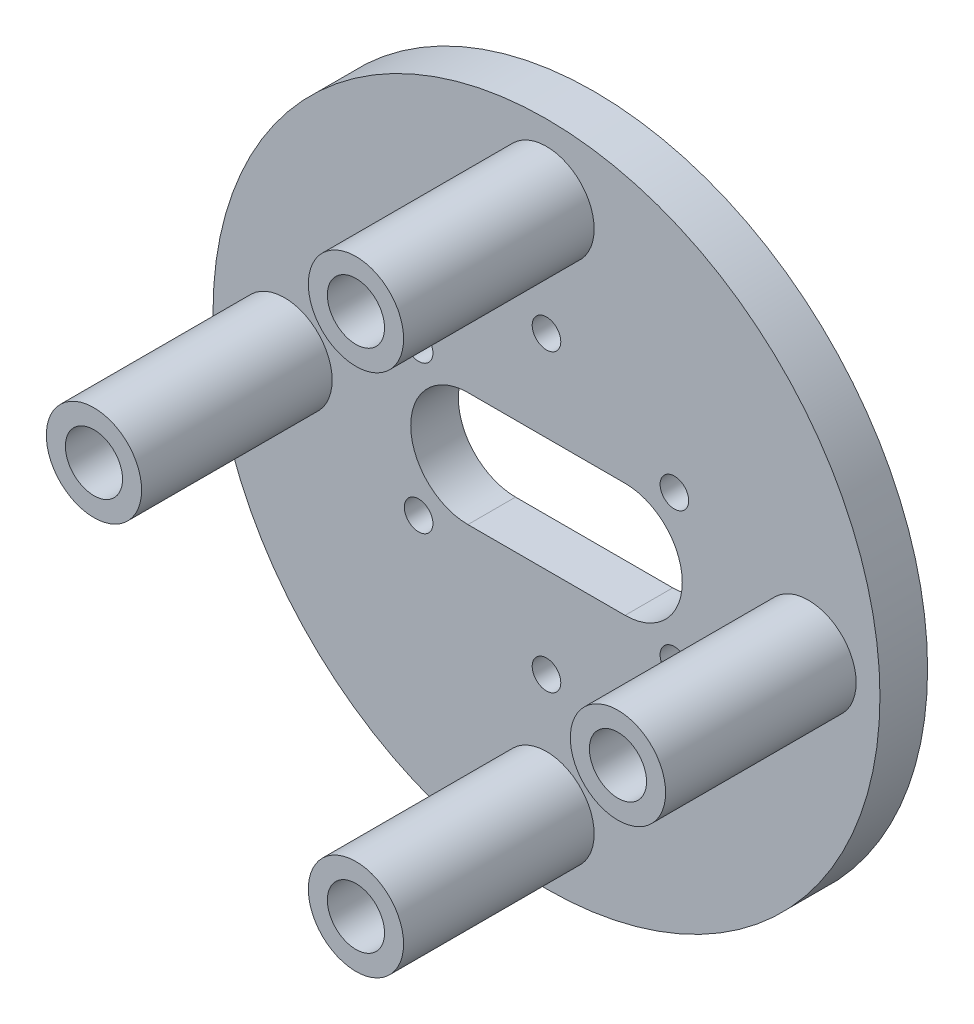
ISO-10303-21;
HEADER;
FILE_DESCRIPTION(('STEP AP214'),'2;1');
FILE_NAME('part.step','',(''),(''),'','','');
FILE_SCHEMA(('AUTOMOTIVE_DESIGN { 1 0 10303 214 1 1 1 1 }'));
ENDSEC;
DATA;
#1=APPLICATION_CONTEXT('core data for automotive mechanical design processes');
#2=APPLICATION_PROTOCOL_DEFINITION('international standard','automotive_design',2000,#1);
#3=PRODUCT_CONTEXT('',#1,'mechanical');
#4=PRODUCT('Part','Part','',(#3));
#5=PRODUCT_RELATED_PRODUCT_CATEGORY('part','',(#4));
#6=PRODUCT_DEFINITION_FORMATION('','',#4);
#7=PRODUCT_DEFINITION_CONTEXT('part definition',#1,'design');
#8=PRODUCT_DEFINITION('design','',#6,#7);
#9=PRODUCT_DEFINITION_SHAPE('','',#8);
#10=(LENGTH_UNIT() NAMED_UNIT(*) SI_UNIT(.MILLI.,.METRE.));
#11=(NAMED_UNIT(*) PLANE_ANGLE_UNIT() SI_UNIT($,.RADIAN.));
#12=(NAMED_UNIT(*) SI_UNIT($,.STERADIAN.) SOLID_ANGLE_UNIT());
#13=UNCERTAINTY_MEASURE_WITH_UNIT(LENGTH_MEASURE(1.E-05),#10,'distance_accuracy_value','');
#14=(GEOMETRIC_REPRESENTATION_CONTEXT(3) GLOBAL_UNCERTAINTY_ASSIGNED_CONTEXT((#13)) GLOBAL_UNIT_ASSIGNED_CONTEXT((#10,
#11,#12)) REPRESENTATION_CONTEXT('',''));
#15=CARTESIAN_POINT('',(0.,0.,0.));
#16=DIRECTION('',(0.,0.,1.));
#17=DIRECTION('',(1.,0.,0.));
#18=AXIS2_PLACEMENT_3D('',#15,#16,#17);
#19=CARTESIAN_POINT('',(0.,0.,5.));
#20=DIRECTION('',(0.,0.,-1.));
#21=DIRECTION('',(-1.,0.,0.));
#22=AXIS2_PLACEMENT_3D('',#19,#20,#21);
#23=CYLINDRICAL_SURFACE('',#22,35.);
#24=CARTESIAN_POINT('',(0.,0.,5.));
#25=DIRECTION('',(0.,0.,1.));
#26=DIRECTION('',(1.,0.,0.));
#27=AXIS2_PLACEMENT_3D('',#24,#25,#26);
#28=CIRCLE('',#27,35.);
#29=CARTESIAN_POINT('',(35.,0.,5.));
#30=VERTEX_POINT('',#29);
#31=EDGE_CURVE('E151',#30,#30,#28,.T.);
#32=ORIENTED_EDGE('',*,*,#31,.F.);
#33=EDGE_LOOP('',(#32));
#34=FACE_BOUND('',#33,.T.);
#35=CARTESIAN_POINT('',(0.,0.,0.));
#36=DIRECTION('',(0.,0.,1.));
#37=DIRECTION('',(1.,0.,0.));
#38=AXIS2_PLACEMENT_3D('',#35,#36,#37);
#39=CIRCLE('',#38,35.);
#40=CARTESIAN_POINT('',(35.,0.,0.));
#41=VERTEX_POINT('',#40);
#42=EDGE_CURVE('E148',#41,#41,#39,.T.);
#43=ORIENTED_EDGE('',*,*,#42,.T.);
#44=EDGE_LOOP('',(#43));
#45=FACE_BOUND('',#44,.T.);
#46=ADVANCED_FACE('F32',(#34,#45),#23,.T.);
#47=CARTESIAN_POINT('',(0.,0.,5.));
#48=DIRECTION('',(0.,0.,1.));
#49=DIRECTION('',(1.,0.,0.));
#50=AXIS2_PLACEMENT_3D('',#47,#48,#49);
#51=PLANE('',#50);
#52=CARTESIAN_POINT('',(0.,15.5,5.));
#53=DIRECTION('',(0.,0.,1.));
#54=DIRECTION('',(1.,0.,0.));
#55=AXIS2_PLACEMENT_3D('',#52,#53,#54);
#56=CIRCLE('',#55,1.5);
#57=CARTESIAN_POINT('',(1.5,15.5,5.));
#58=VERTEX_POINT('',#57);
#59=EDGE_CURVE('E192',#58,#58,#56,.T.);
#60=ORIENTED_EDGE('',*,*,#59,.F.);
#61=EDGE_LOOP('',(#60));
#62=FACE_BOUND('',#61,.T.);
#63=CARTESIAN_POINT('',(-13.4233937586588,7.75000000000006,5.));
#64=DIRECTION('',(0.,0.,1.));
#65=DIRECTION('',(1.,0.,0.));
#66=AXIS2_PLACEMENT_3D('',#63,#64,#65);
#67=CIRCLE('',#66,1.5);
#68=CARTESIAN_POINT('',(-11.9233937586588,7.75000000000006,5.));
#69=VERTEX_POINT('',#68);
#70=EDGE_CURVE('E195',#69,#69,#67,.T.);
#71=ORIENTED_EDGE('',*,*,#70,.F.);
#72=EDGE_LOOP('',(#71));
#73=FACE_BOUND('',#72,.T.);
#74=CARTESIAN_POINT('',(-13.4233937586588,-7.74999999999997,5.));
#75=DIRECTION('',(0.,0.,1.));
#76=DIRECTION('',(1.,0.,0.));
#77=AXIS2_PLACEMENT_3D('',#74,#75,#76);
#78=CIRCLE('',#77,1.5);
#79=CARTESIAN_POINT('',(-11.9233937586588,-7.74999999999997,5.));
#80=VERTEX_POINT('',#79);
#81=EDGE_CURVE('E189',#80,#80,#78,.T.);
#82=ORIENTED_EDGE('',*,*,#81,.F.);
#83=EDGE_LOOP('',(#82));
#84=FACE_BOUND('',#83,.T.);
#85=CARTESIAN_POINT('',(0.,-15.5,5.));
#86=DIRECTION('',(0.,0.,1.));
#87=DIRECTION('',(1.,0.,0.));
#88=AXIS2_PLACEMENT_3D('',#85,#86,#87);
#89=CIRCLE('',#88,1.5);
#90=CARTESIAN_POINT('',(1.5,-15.5,5.));
#91=VERTEX_POINT('',#90);
#92=EDGE_CURVE('E186',#91,#91,#89,.T.);
#93=ORIENTED_EDGE('',*,*,#92,.F.);
#94=EDGE_LOOP('',(#93));
#95=FACE_BOUND('',#94,.T.);
#96=CARTESIAN_POINT('',(13.4233937586587,-7.75000000000016,5.));
#97=DIRECTION('',(0.,0.,1.));
#98=DIRECTION('',(1.,0.,0.));
#99=AXIS2_PLACEMENT_3D('',#96,#97,#98);
#100=CIRCLE('',#99,1.5);
#101=CARTESIAN_POINT('',(14.9233937586587,-7.75000000000016,5.));
#102=VERTEX_POINT('',#101);
#103=EDGE_CURVE('E169',#102,#102,#100,.T.);
#104=ORIENTED_EDGE('',*,*,#103,.F.);
#105=EDGE_LOOP('',(#104));
#106=FACE_BOUND('',#105,.T.);
#107=CARTESIAN_POINT('',(13.4233937586589,7.74999999999987,5.));
#108=DIRECTION('',(0.,0.,1.));
#109=DIRECTION('',(1.,0.,0.));
#110=AXIS2_PLACEMENT_3D('',#107,#108,#109);
#111=CIRCLE('',#110,1.5);
#112=CARTESIAN_POINT('',(14.9233937586589,7.74999999999987,5.));
#113=VERTEX_POINT('',#112);
#114=EDGE_CURVE('E164',#113,#113,#111,.T.);
#115=ORIENTED_EDGE('',*,*,#114,.F.);
#116=EDGE_LOOP('',(#115));
#117=FACE_BOUND('',#116,.T.);
#118=CARTESIAN_POINT('',(8.25,0.,5.));
#119=DIRECTION('',(0.,0.,1.));
#120=DIRECTION('',(1.,0.,0.));
#121=AXIS2_PLACEMENT_3D('',#118,#119,#120);
#122=CIRCLE('',#121,6.);
#123=CARTESIAN_POINT('',(8.25,-6.,5.));
#124=VERTEX_POINT('',#123);
#125=CARTESIAN_POINT('',(8.25,6.,5.));
#126=VERTEX_POINT('',#125);
#127=EDGE_CURVE('E48',#124,#126,#122,.T.);
#128=ORIENTED_EDGE('',*,*,#127,.F.);
#129=DIRECTION('',(1.,0.,0.));
#130=VECTOR('',#129,1.);
#131=CARTESIAN_POINT('',(8.25,-6.,5.));
#132=LINE('',#131,#130);
#133=CARTESIAN_POINT('',(-8.25,-6.,5.));
#134=VERTEX_POINT('',#133);
#135=EDGE_CURVE('E93',#134,#124,#132,.T.);
#136=ORIENTED_EDGE('',*,*,#135,.F.);
#137=CARTESIAN_POINT('',(-8.25,0.,5.));
#138=DIRECTION('',(0.,0.,1.));
#139=DIRECTION('',(1.,0.,0.));
#140=AXIS2_PLACEMENT_3D('',#137,#138,#139);
#141=CIRCLE('',#140,6.);
#142=CARTESIAN_POINT('',(-8.25,6.,5.));
#143=VERTEX_POINT('',#142);
#144=EDGE_CURVE('E77',#143,#134,#141,.T.);
#145=ORIENTED_EDGE('',*,*,#144,.F.);
#146=DIRECTION('',(-1.,0.,0.));
#147=VECTOR('',#146,1.);
#148=CARTESIAN_POINT('',(8.25,6.,5.));
#149=LINE('',#148,#147);
#150=EDGE_CURVE('E86',#126,#143,#149,.T.);
#151=ORIENTED_EDGE('',*,*,#150,.F.);
#152=EDGE_LOOP('',(#128,#136,#145,#151));
#153=FACE_BOUND('',#152,.T.);
#154=CARTESIAN_POINT('',(-27.5,0.,5.));
#155=DIRECTION('',(0.,0.,1.));
#156=DIRECTION('',(1.,0.,0.));
#157=AXIS2_PLACEMENT_3D('',#154,#155,#156);
#158=CIRCLE('',#157,5.);
#159=CARTESIAN_POINT('',(-22.5,0.,5.));
#160=VERTEX_POINT('',#159);
#161=EDGE_CURVE('E124',#160,#160,#158,.T.);
#162=ORIENTED_EDGE('',*,*,#161,.F.);
#163=EDGE_LOOP('',(#162));
#164=FACE_BOUND('',#163,.T.);
#165=CARTESIAN_POINT('',(0.,27.5,5.));
#166=DIRECTION('',(0.,0.,1.));
#167=DIRECTION('',(1.,0.,0.));
#168=AXIS2_PLACEMENT_3D('',#165,#166,#167);
#169=CIRCLE('',#168,5.);
#170=CARTESIAN_POINT('',(5.,27.5,5.));
#171=VERTEX_POINT('',#170);
#172=EDGE_CURVE('E130',#171,#171,#169,.T.);
#173=ORIENTED_EDGE('',*,*,#172,.F.);
#174=EDGE_LOOP('',(#173));
#175=FACE_BOUND('',#174,.T.);
#176=CARTESIAN_POINT('',(0.,-27.5,5.));
#177=DIRECTION('',(0.,0.,1.));
#178=DIRECTION('',(1.,0.,0.));
#179=AXIS2_PLACEMENT_3D('',#176,#177,#178);
#180=CIRCLE('',#179,5.);
#181=CARTESIAN_POINT('',(5.,-27.5,5.));
#182=VERTEX_POINT('',#181);
#183=EDGE_CURVE('E136',#182,#182,#180,.T.);
#184=ORIENTED_EDGE('',*,*,#183,.F.);
#185=EDGE_LOOP('',(#184));
#186=FACE_BOUND('',#185,.T.);
#187=CARTESIAN_POINT('',(27.5,0.,5.));
#188=DIRECTION('',(0.,0.,1.));
#189=DIRECTION('',(1.,0.,0.));
#190=AXIS2_PLACEMENT_3D('',#187,#188,#189);
#191=CIRCLE('',#190,5.);
#192=CARTESIAN_POINT('',(32.5,0.,5.));
#193=VERTEX_POINT('',#192);
#194=EDGE_CURVE('E142',#193,#193,#191,.T.);
#195=ORIENTED_EDGE('',*,*,#194,.F.);
#196=EDGE_LOOP('',(#195));
#197=FACE_BOUND('',#196,.T.);
#198=ORIENTED_EDGE('',*,*,#31,.T.);
#199=EDGE_LOOP('',(#198));
#200=FACE_BOUND('',#199,.T.);
#201=ADVANCED_FACE('F90',(#62,#73,#84,#95,#106,#117,#153,#164,#175,#186,#197,#200),#51,.T.);
#202=CARTESIAN_POINT('',(0.,0.,0.));
#203=DIRECTION('',(0.,0.,1.));
#204=DIRECTION('',(1.,0.,0.));
#205=AXIS2_PLACEMENT_3D('',#202,#203,#204);
#206=PLANE('',#205);
#207=CARTESIAN_POINT('',(0.,15.5,0.));
#208=DIRECTION('',(0.,0.,1.));
#209=DIRECTION('',(1.,0.,0.));
#210=AXIS2_PLACEMENT_3D('',#207,#208,#209);
#211=CIRCLE('',#210,1.5);
#212=CARTESIAN_POINT('',(1.5,15.5,0.));
#213=VERTEX_POINT('',#212);
#214=EDGE_CURVE('E35',#213,#213,#211,.T.);
#215=ORIENTED_EDGE('',*,*,#214,.T.);
#216=EDGE_LOOP('',(#215));
#217=FACE_BOUND('',#216,.T.);
#218=CARTESIAN_POINT('',(-13.4233937586588,7.75000000000006,0.));
#219=DIRECTION('',(0.,0.,1.));
#220=DIRECTION('',(1.,0.,0.));
#221=AXIS2_PLACEMENT_3D('',#218,#219,#220);
#222=CIRCLE('',#221,1.5);
#223=CARTESIAN_POINT('',(-11.9233937586588,7.75000000000006,0.));
#224=VERTEX_POINT('',#223);
#225=EDGE_CURVE('E174',#224,#224,#222,.T.);
#226=ORIENTED_EDGE('',*,*,#225,.T.);
#227=EDGE_LOOP('',(#226));
#228=FACE_BOUND('',#227,.T.);
#229=CARTESIAN_POINT('',(-13.4233937586588,-7.74999999999997,0.));
#230=DIRECTION('',(0.,0.,1.));
#231=DIRECTION('',(1.,0.,0.));
#232=AXIS2_PLACEMENT_3D('',#229,#230,#231);
#233=CIRCLE('',#232,1.5);
#234=CARTESIAN_POINT('',(-11.9233937586588,-7.74999999999997,0.));
#235=VERTEX_POINT('',#234);
#236=EDGE_CURVE('E172',#235,#235,#233,.T.);
#237=ORIENTED_EDGE('',*,*,#236,.T.);
#238=EDGE_LOOP('',(#237));
#239=FACE_BOUND('',#238,.T.);
#240=CARTESIAN_POINT('',(0.,-15.5,0.));
#241=DIRECTION('',(0.,0.,1.));
#242=DIRECTION('',(1.,0.,0.));
#243=AXIS2_PLACEMENT_3D('',#240,#241,#242);
#244=CIRCLE('',#243,1.5);
#245=CARTESIAN_POINT('',(1.5,-15.5,0.));
#246=VERTEX_POINT('',#245);
#247=EDGE_CURVE('E168',#246,#246,#244,.T.);
#248=ORIENTED_EDGE('',*,*,#247,.T.);
#249=EDGE_LOOP('',(#248));
#250=FACE_BOUND('',#249,.T.);
#251=CARTESIAN_POINT('',(13.4233937586587,-7.75000000000016,0.));
#252=DIRECTION('',(0.,0.,1.));
#253=DIRECTION('',(1.,0.,0.));
#254=AXIS2_PLACEMENT_3D('',#251,#252,#253);
#255=CIRCLE('',#254,1.5);
#256=CARTESIAN_POINT('',(14.9233937586587,-7.75000000000016,0.));
#257=VERTEX_POINT('',#256);
#258=EDGE_CURVE('E165',#257,#257,#255,.T.);
#259=ORIENTED_EDGE('',*,*,#258,.T.);
#260=EDGE_LOOP('',(#259));
#261=FACE_BOUND('',#260,.T.);
#262=CARTESIAN_POINT('',(13.4233937586589,7.74999999999987,0.));
#263=DIRECTION('',(0.,0.,1.));
#264=DIRECTION('',(1.,0.,0.));
#265=AXIS2_PLACEMENT_3D('',#262,#263,#264);
#266=CIRCLE('',#265,1.5);
#267=CARTESIAN_POINT('',(14.9233937586589,7.74999999999987,0.));
#268=VERTEX_POINT('',#267);
#269=EDGE_CURVE('E161',#268,#268,#266,.T.);
#270=ORIENTED_EDGE('',*,*,#269,.T.);
#271=EDGE_LOOP('',(#270));
#272=FACE_BOUND('',#271,.T.);
#273=DIRECTION('',(1.,0.,0.));
#274=VECTOR('',#273,1.);
#275=CARTESIAN_POINT('',(0.,-6.,0.));
#276=LINE('',#275,#274);
#277=CARTESIAN_POINT('',(-8.25,-6.,0.));
#278=VERTEX_POINT('',#277);
#279=CARTESIAN_POINT('',(8.25,-6.,0.));
#280=VERTEX_POINT('',#279);
#281=EDGE_CURVE('E40',#278,#280,#276,.T.);
#282=ORIENTED_EDGE('',*,*,#281,.T.);
#283=CARTESIAN_POINT('',(8.25,0.,0.));
#284=DIRECTION('',(0.,0.,1.));
#285=DIRECTION('',(1.,0.,0.));
#286=AXIS2_PLACEMENT_3D('',#283,#284,#285);
#287=CIRCLE('',#286,6.);
#288=CARTESIAN_POINT('',(8.25,6.,0.));
#289=VERTEX_POINT('',#288);
#290=EDGE_CURVE('E11',#280,#289,#287,.T.);
#291=ORIENTED_EDGE('',*,*,#290,.T.);
#292=DIRECTION('',(-1.,0.,0.));
#293=VECTOR('',#292,1.);
#294=CARTESIAN_POINT('',(0.,6.,0.));
#295=LINE('',#294,#293);
#296=CARTESIAN_POINT('',(-8.25,6.,0.));
#297=VERTEX_POINT('',#296);
#298=EDGE_CURVE('E154',#289,#297,#295,.T.);
#299=ORIENTED_EDGE('',*,*,#298,.T.);
#300=CARTESIAN_POINT('',(-8.25,0.,0.));
#301=DIRECTION('',(0.,0.,1.));
#302=DIRECTION('',(1.,0.,0.));
#303=AXIS2_PLACEMENT_3D('',#300,#301,#302);
#304=CIRCLE('',#303,6.);
#305=EDGE_CURVE('E80',#297,#278,#304,.T.);
#306=ORIENTED_EDGE('',*,*,#305,.T.);
#307=EDGE_LOOP('',(#282,#291,#299,#306));
#308=FACE_BOUND('',#307,.T.);
#309=ORIENTED_EDGE('',*,*,#42,.F.);
#310=EDGE_LOOP('',(#309));
#311=FACE_BOUND('',#310,.T.);
#312=ADVANCED_FACE('F206',(#217,#228,#239,#250,#261,#272,#308,#311),#206,.F.);
#313=CARTESIAN_POINT('',(27.5,0.,25.));
#314=DIRECTION('',(0.,0.,-1.));
#315=DIRECTION('',(-1.,0.,0.));
#316=AXIS2_PLACEMENT_3D('',#313,#314,#315);
#317=CYLINDRICAL_SURFACE('',#316,5.);
#318=CARTESIAN_POINT('',(27.5,0.,25.));
#319=DIRECTION('',(0.,0.,1.));
#320=DIRECTION('',(1.,0.,0.));
#321=AXIS2_PLACEMENT_3D('',#318,#319,#320);
#322=CIRCLE('',#321,5.);
#323=CARTESIAN_POINT('',(32.5,0.,25.));
#324=VERTEX_POINT('',#323);
#325=EDGE_CURVE('E145',#324,#324,#322,.T.);
#326=ORIENTED_EDGE('',*,*,#325,.F.);
#327=EDGE_LOOP('',(#326));
#328=FACE_BOUND('',#327,.T.);
#329=ORIENTED_EDGE('',*,*,#194,.T.);
#330=EDGE_LOOP('',(#329));
#331=FACE_BOUND('',#330,.T.);
#332=ADVANCED_FACE('F224',(#328,#331),#317,.T.);
#333=CARTESIAN_POINT('',(27.5,0.,25.));
#334=DIRECTION('',(0.,0.,1.));
#335=DIRECTION('',(1.,0.,0.));
#336=AXIS2_PLACEMENT_3D('',#333,#334,#335);
#337=PLANE('',#336);
#338=CARTESIAN_POINT('',(27.5,0.,25.));
#339=DIRECTION('',(0.,0.,1.));
#340=DIRECTION('',(1.,0.,0.));
#341=AXIS2_PLACEMENT_3D('',#338,#339,#340);
#342=CIRCLE('',#341,3.);
#343=CARTESIAN_POINT('',(30.5,0.,25.));
#344=VERTEX_POINT('',#343);
#345=EDGE_CURVE('E107',#344,#344,#342,.T.);
#346=ORIENTED_EDGE('',*,*,#345,.F.);
#347=EDGE_LOOP('',(#346));
#348=FACE_BOUND('',#347,.T.);
#349=ORIENTED_EDGE('',*,*,#325,.T.);
#350=EDGE_LOOP('',(#349));
#351=FACE_BOUND('',#350,.T.);
#352=ADVANCED_FACE('F252',(#348,#351),#337,.T.);
#353=CARTESIAN_POINT('',(0.,-27.5,25.));
#354=DIRECTION('',(0.,0.,-1.));
#355=DIRECTION('',(-1.,0.,0.));
#356=AXIS2_PLACEMENT_3D('',#353,#354,#355);
#357=CYLINDRICAL_SURFACE('',#356,5.);
#358=CARTESIAN_POINT('',(0.,-27.5,25.));
#359=DIRECTION('',(0.,0.,1.));
#360=DIRECTION('',(1.,0.,0.));
#361=AXIS2_PLACEMENT_3D('',#358,#359,#360);
#362=CIRCLE('',#361,5.);
#363=CARTESIAN_POINT('',(5.,-27.5,25.));
#364=VERTEX_POINT('',#363);
#365=EDGE_CURVE('E139',#364,#364,#362,.T.);
#366=ORIENTED_EDGE('',*,*,#365,.F.);
#367=EDGE_LOOP('',(#366));
#368=FACE_BOUND('',#367,.T.);
#369=ORIENTED_EDGE('',*,*,#183,.T.);
#370=EDGE_LOOP('',(#369));
#371=FACE_BOUND('',#370,.T.);
#372=ADVANCED_FACE('F261',(#368,#371),#357,.T.);
#373=CARTESIAN_POINT('',(0.,-27.5,25.));
#374=DIRECTION('',(0.,0.,1.));
#375=DIRECTION('',(1.,0.,0.));
#376=AXIS2_PLACEMENT_3D('',#373,#374,#375);
#377=PLANE('',#376);
#378=CARTESIAN_POINT('',(0.,-27.5,25.));
#379=DIRECTION('',(0.,0.,1.));
#380=DIRECTION('',(1.,0.,0.));
#381=AXIS2_PLACEMENT_3D('',#378,#379,#380);
#382=CIRCLE('',#381,3.);
#383=CARTESIAN_POINT('',(3.,-27.5,25.));
#384=VERTEX_POINT('',#383);
#385=EDGE_CURVE('E113',#384,#384,#382,.T.);
#386=ORIENTED_EDGE('',*,*,#385,.F.);
#387=EDGE_LOOP('',(#386));
#388=FACE_BOUND('',#387,.T.);
#389=ORIENTED_EDGE('',*,*,#365,.T.);
#390=EDGE_LOOP('',(#389));
#391=FACE_BOUND('',#390,.T.);
#392=ADVANCED_FACE('F270',(#388,#391),#377,.T.);
#393=CARTESIAN_POINT('',(0.,27.5,25.));
#394=DIRECTION('',(0.,0.,-1.));
#395=DIRECTION('',(-1.,0.,0.));
#396=AXIS2_PLACEMENT_3D('',#393,#394,#395);
#397=CYLINDRICAL_SURFACE('',#396,5.);
#398=CARTESIAN_POINT('',(0.,27.5,25.));
#399=DIRECTION('',(0.,0.,1.));
#400=DIRECTION('',(1.,0.,0.));
#401=AXIS2_PLACEMENT_3D('',#398,#399,#400);
#402=CIRCLE('',#401,5.);
#403=CARTESIAN_POINT('',(5.,27.5,25.));
#404=VERTEX_POINT('',#403);
#405=EDGE_CURVE('E133',#404,#404,#402,.T.);
#406=ORIENTED_EDGE('',*,*,#405,.F.);
#407=EDGE_LOOP('',(#406));
#408=FACE_BOUND('',#407,.T.);
#409=ORIENTED_EDGE('',*,*,#172,.T.);
#410=EDGE_LOOP('',(#409));
#411=FACE_BOUND('',#410,.T.);
#412=ADVANCED_FACE('F278',(#408,#411),#397,.T.);
#413=CARTESIAN_POINT('',(0.,27.5,25.));
#414=DIRECTION('',(0.,0.,1.));
#415=DIRECTION('',(1.,0.,0.));
#416=AXIS2_PLACEMENT_3D('',#413,#414,#415);
#417=PLANE('',#416);
#418=CARTESIAN_POINT('',(0.,27.5,25.));
#419=DIRECTION('',(0.,0.,1.));
#420=DIRECTION('',(1.,0.,0.));
#421=AXIS2_PLACEMENT_3D('',#418,#419,#420);
#422=CIRCLE('',#421,3.);
#423=CARTESIAN_POINT('',(3.,27.5,25.));
#424=VERTEX_POINT('',#423);
#425=EDGE_CURVE('E106',#424,#424,#422,.T.);
#426=ORIENTED_EDGE('',*,*,#425,.F.);
#427=EDGE_LOOP('',(#426));
#428=FACE_BOUND('',#427,.T.);
#429=ORIENTED_EDGE('',*,*,#405,.T.);
#430=EDGE_LOOP('',(#429));
#431=FACE_BOUND('',#430,.T.);
#432=ADVANCED_FACE('F286',(#428,#431),#417,.T.);
#433=CARTESIAN_POINT('',(-27.5,0.,25.));
#434=DIRECTION('',(0.,0.,-1.));
#435=DIRECTION('',(-1.,0.,0.));
#436=AXIS2_PLACEMENT_3D('',#433,#434,#435);
#437=CYLINDRICAL_SURFACE('',#436,5.);
#438=CARTESIAN_POINT('',(-27.5,0.,25.));
#439=DIRECTION('',(0.,0.,1.));
#440=DIRECTION('',(1.,0.,0.));
#441=AXIS2_PLACEMENT_3D('',#438,#439,#440);
#442=CIRCLE('',#441,5.);
#443=CARTESIAN_POINT('',(-22.5,0.,25.));
#444=VERTEX_POINT('',#443);
#445=EDGE_CURVE('E127',#444,#444,#442,.T.);
#446=ORIENTED_EDGE('',*,*,#445,.F.);
#447=EDGE_LOOP('',(#446));
#448=FACE_BOUND('',#447,.T.);
#449=ORIENTED_EDGE('',*,*,#161,.T.);
#450=EDGE_LOOP('',(#449));
#451=FACE_BOUND('',#450,.T.);
#452=ADVANCED_FACE('F293',(#448,#451),#437,.T.);
#453=CARTESIAN_POINT('',(-27.5,0.,25.));
#454=DIRECTION('',(0.,0.,1.));
#455=DIRECTION('',(1.,0.,0.));
#456=AXIS2_PLACEMENT_3D('',#453,#454,#455);
#457=PLANE('',#456);
#458=CARTESIAN_POINT('',(-27.5,0.,25.));
#459=DIRECTION('',(0.,0.,1.));
#460=DIRECTION('',(1.,0.,0.));
#461=AXIS2_PLACEMENT_3D('',#458,#459,#460);
#462=CIRCLE('',#461,3.);
#463=CARTESIAN_POINT('',(-24.5,0.,25.));
#464=VERTEX_POINT('',#463);
#465=EDGE_CURVE('E100',#464,#464,#462,.T.);
#466=ORIENTED_EDGE('',*,*,#465,.F.);
#467=EDGE_LOOP('',(#466));
#468=FACE_BOUND('',#467,.T.);
#469=ORIENTED_EDGE('',*,*,#445,.T.);
#470=EDGE_LOOP('',(#469));
#471=FACE_BOUND('',#470,.T.);
#472=ADVANCED_FACE('F301',(#468,#471),#457,.T.);
#473=CARTESIAN_POINT('',(0.,27.5,20.));
#474=DIRECTION('',(0.,0.,1.));
#475=DIRECTION('',(1.,0.,0.));
#476=AXIS2_PLACEMENT_3D('',#473,#474,#475);
#477=CYLINDRICAL_SURFACE('',#476,3.);
#478=CARTESIAN_POINT('',(0.,27.5,20.));
#479=DIRECTION('',(0.,0.,1.));
#480=DIRECTION('',(1.,0.,0.));
#481=AXIS2_PLACEMENT_3D('',#478,#479,#480);
#482=CIRCLE('',#481,3.);
#483=CARTESIAN_POINT('',(3.,27.5,20.));
#484=VERTEX_POINT('',#483);
#485=EDGE_CURVE('E121',#484,#484,#482,.T.);
#486=ORIENTED_EDGE('',*,*,#485,.F.);
#487=EDGE_LOOP('',(#486));
#488=FACE_BOUND('',#487,.T.);
#489=ORIENTED_EDGE('',*,*,#425,.T.);
#490=EDGE_LOOP('',(#489));
#491=FACE_BOUND('',#490,.T.);
#492=ADVANCED_FACE('F308',(#488,#491),#477,.F.);
#493=CARTESIAN_POINT('',(0.,27.5,20.));
#494=DIRECTION('',(0.,0.,1.));
#495=DIRECTION('',(1.,0.,0.));
#496=AXIS2_PLACEMENT_3D('',#493,#494,#495);
#497=PLANE('',#496);
#498=ORIENTED_EDGE('',*,*,#485,.T.);
#499=EDGE_LOOP('',(#498));
#500=FACE_BOUND('',#499,.T.);
#501=ADVANCED_FACE('F316',(#500),#497,.T.);
#502=CARTESIAN_POINT('',(-27.5,0.,20.));
#503=DIRECTION('',(0.,0.,1.));
#504=DIRECTION('',(1.,0.,0.));
#505=AXIS2_PLACEMENT_3D('',#502,#503,#504);
#506=CYLINDRICAL_SURFACE('',#505,3.);
#507=CARTESIAN_POINT('',(-27.5,0.,20.));
#508=DIRECTION('',(0.,0.,1.));
#509=DIRECTION('',(1.,0.,0.));
#510=AXIS2_PLACEMENT_3D('',#507,#508,#509);
#511=CIRCLE('',#510,3.);
#512=CARTESIAN_POINT('',(-24.5,0.,20.));
#513=VERTEX_POINT('',#512);
#514=EDGE_CURVE('E116',#513,#513,#511,.T.);
#515=ORIENTED_EDGE('',*,*,#514,.F.);
#516=EDGE_LOOP('',(#515));
#517=FACE_BOUND('',#516,.T.);
#518=ORIENTED_EDGE('',*,*,#465,.T.);
#519=EDGE_LOOP('',(#518));
#520=FACE_BOUND('',#519,.T.);
#521=ADVANCED_FACE('F324',(#517,#520),#506,.F.);
#522=CARTESIAN_POINT('',(-27.5,0.,20.));
#523=DIRECTION('',(0.,0.,1.));
#524=DIRECTION('',(1.,0.,0.));
#525=AXIS2_PLACEMENT_3D('',#522,#523,#524);
#526=PLANE('',#525);
#527=ORIENTED_EDGE('',*,*,#514,.T.);
#528=EDGE_LOOP('',(#527));
#529=FACE_BOUND('',#528,.T.);
#530=ADVANCED_FACE('F332',(#529),#526,.T.);
#531=CARTESIAN_POINT('',(0.,-27.5,20.));
#532=DIRECTION('',(0.,0.,1.));
#533=DIRECTION('',(1.,0.,0.));
#534=AXIS2_PLACEMENT_3D('',#531,#532,#533);
#535=CYLINDRICAL_SURFACE('',#534,3.);
#536=CARTESIAN_POINT('',(0.,-27.5,20.));
#537=DIRECTION('',(0.,0.,1.));
#538=DIRECTION('',(1.,0.,0.));
#539=AXIS2_PLACEMENT_3D('',#536,#537,#538);
#540=CIRCLE('',#539,3.);
#541=CARTESIAN_POINT('',(3.,-27.5,20.));
#542=VERTEX_POINT('',#541);
#543=EDGE_CURVE('E110',#542,#542,#540,.T.);
#544=ORIENTED_EDGE('',*,*,#543,.F.);
#545=EDGE_LOOP('',(#544));
#546=FACE_BOUND('',#545,.T.);
#547=ORIENTED_EDGE('',*,*,#385,.T.);
#548=EDGE_LOOP('',(#547));
#549=FACE_BOUND('',#548,.T.);
#550=ADVANCED_FACE('F340',(#546,#549),#535,.F.);
#551=CARTESIAN_POINT('',(0.,-27.5,20.));
#552=DIRECTION('',(0.,0.,1.));
#553=DIRECTION('',(1.,0.,0.));
#554=AXIS2_PLACEMENT_3D('',#551,#552,#553);
#555=PLANE('',#554);
#556=ORIENTED_EDGE('',*,*,#543,.T.);
#557=EDGE_LOOP('',(#556));
#558=FACE_BOUND('',#557,.T.);
#559=ADVANCED_FACE('F348',(#558),#555,.T.);
#560=CARTESIAN_POINT('',(27.5,0.,20.));
#561=DIRECTION('',(0.,0.,1.));
#562=DIRECTION('',(1.,0.,0.));
#563=AXIS2_PLACEMENT_3D('',#560,#561,#562);
#564=CYLINDRICAL_SURFACE('',#563,3.);
#565=CARTESIAN_POINT('',(27.5,0.,20.));
#566=DIRECTION('',(0.,0.,1.));
#567=DIRECTION('',(1.,0.,0.));
#568=AXIS2_PLACEMENT_3D('',#565,#566,#567);
#569=CIRCLE('',#568,3.);
#570=CARTESIAN_POINT('',(30.5,0.,20.));
#571=VERTEX_POINT('',#570);
#572=EDGE_CURVE('E103',#571,#571,#569,.T.);
#573=ORIENTED_EDGE('',*,*,#572,.F.);
#574=EDGE_LOOP('',(#573));
#575=FACE_BOUND('',#574,.T.);
#576=ORIENTED_EDGE('',*,*,#345,.T.);
#577=EDGE_LOOP('',(#576));
#578=FACE_BOUND('',#577,.T.);
#579=ADVANCED_FACE('F356',(#575,#578),#564,.F.);
#580=CARTESIAN_POINT('',(27.5,0.,20.));
#581=DIRECTION('',(0.,0.,1.));
#582=DIRECTION('',(1.,0.,0.));
#583=AXIS2_PLACEMENT_3D('',#580,#581,#582);
#584=PLANE('',#583);
#585=ORIENTED_EDGE('',*,*,#572,.T.);
#586=EDGE_LOOP('',(#585));
#587=FACE_BOUND('',#586,.T.);
#588=ADVANCED_FACE('F364',(#587),#584,.T.);
#589=CARTESIAN_POINT('',(8.25,0.,-9.00000000000001));
#590=DIRECTION('',(0.,0.,1.));
#591=DIRECTION('',(1.,0.,0.));
#592=AXIS2_PLACEMENT_3D('',#589,#590,#591);
#593=CYLINDRICAL_SURFACE('',#592,6.);
#594=DIRECTION('',(0.,0.,1.));
#595=VECTOR('',#594,1.);
#596=CARTESIAN_POINT('',(8.25,-6.,-9.00000000000001));
#597=LINE('',#596,#595);
#598=EDGE_CURVE('E98',#280,#124,#597,.T.);
#599=ORIENTED_EDGE('',*,*,#598,.T.);
#600=ORIENTED_EDGE('',*,*,#127,.T.);
#601=DIRECTION('',(0.,0.,1.));
#602=VECTOR('',#601,1.);
#603=CARTESIAN_POINT('',(8.25,6.,-9.00000000000001));
#604=LINE('',#603,#602);
#605=EDGE_CURVE('E83',#289,#126,#604,.T.);
#606=ORIENTED_EDGE('',*,*,#605,.F.);
#607=ORIENTED_EDGE('',*,*,#290,.F.);
#608=EDGE_LOOP('',(#599,#600,#606,#607));
#609=FACE_BOUND('',#608,.T.);
#610=ADVANCED_FACE('F372',(#609),#593,.F.);
#611=CARTESIAN_POINT('',(8.25,-6.,-9.00000000000001));
#612=DIRECTION('',(0.,-1.,0.));
#613=DIRECTION('',(1.,0.,0.));
#614=AXIS2_PLACEMENT_3D('',#611,#612,#613);
#615=PLANE('',#614);
#616=DIRECTION('',(0.,0.,1.));
#617=VECTOR('',#616,1.);
#618=CARTESIAN_POINT('',(-8.25,-6.,-9.00000000000001));
#619=LINE('',#618,#617);
#620=EDGE_CURVE('E82',#278,#134,#619,.T.);
#621=ORIENTED_EDGE('',*,*,#620,.T.);
#622=ORIENTED_EDGE('',*,*,#135,.T.);
#623=ORIENTED_EDGE('',*,*,#598,.F.);
#624=ORIENTED_EDGE('',*,*,#281,.F.);
#625=EDGE_LOOP('',(#621,#622,#623,#624));
#626=FACE_BOUND('',#625,.T.);
#627=ADVANCED_FACE('F380',(#626),#615,.F.);
#628=CARTESIAN_POINT('',(-8.25,0.,-9.00000000000001));
#629=DIRECTION('',(0.,0.,1.));
#630=DIRECTION('',(1.,0.,0.));
#631=AXIS2_PLACEMENT_3D('',#628,#629,#630);
#632=CYLINDRICAL_SURFACE('',#631,6.);
#633=DIRECTION('',(0.,0.,1.));
#634=VECTOR('',#633,1.);
#635=CARTESIAN_POINT('',(-8.25,6.,-9.00000000000001));
#636=LINE('',#635,#634);
#637=EDGE_CURVE('E56',#297,#143,#636,.T.);
#638=ORIENTED_EDGE('',*,*,#637,.T.);
#639=ORIENTED_EDGE('',*,*,#144,.T.);
#640=ORIENTED_EDGE('',*,*,#620,.F.);
#641=ORIENTED_EDGE('',*,*,#305,.F.);
#642=EDGE_LOOP('',(#638,#639,#640,#641));
#643=FACE_BOUND('',#642,.T.);
#644=ADVANCED_FACE('F74',(#643),#632,.F.);
#645=CARTESIAN_POINT('',(8.25,6.,-9.00000000000001));
#646=DIRECTION('',(0.,1.,0.));
#647=DIRECTION('',(-1.,0.,0.));
#648=AXIS2_PLACEMENT_3D('',#645,#646,#647);
#649=PLANE('',#648);
#650=ORIENTED_EDGE('',*,*,#605,.T.);
#651=ORIENTED_EDGE('',*,*,#150,.T.);
#652=ORIENTED_EDGE('',*,*,#637,.F.);
#653=ORIENTED_EDGE('',*,*,#298,.F.);
#654=EDGE_LOOP('',(#650,#651,#652,#653));
#655=FACE_BOUND('',#654,.T.);
#656=ADVANCED_FACE('F87',(#655),#649,.F.);
#657=CARTESIAN_POINT('',(13.4233937586589,7.74999999999987,-9.00000000000001));
#658=DIRECTION('',(0.,0.,1.));
#659=DIRECTION('',(1.,0.,0.));
#660=AXIS2_PLACEMENT_3D('',#657,#658,#659);
#661=CYLINDRICAL_SURFACE('',#660,1.5);
#662=ORIENTED_EDGE('',*,*,#114,.T.);
#663=EDGE_LOOP('',(#662));
#664=FACE_BOUND('',#663,.T.);
#665=ORIENTED_EDGE('',*,*,#269,.F.);
#666=EDGE_LOOP('',(#665));
#667=FACE_BOUND('',#666,.T.);
#668=ADVANCED_FACE('F218',(#664,#667),#661,.F.);
#669=CARTESIAN_POINT('',(13.4233937586587,-7.75000000000016,-9.00000000000001));
#670=DIRECTION('',(0.,0.,1.));
#671=DIRECTION('',(1.,0.,0.));
#672=AXIS2_PLACEMENT_3D('',#669,#670,#671);
#673=CYLINDRICAL_SURFACE('',#672,1.5);
#674=ORIENTED_EDGE('',*,*,#103,.T.);
#675=EDGE_LOOP('',(#674));
#676=FACE_BOUND('',#675,.T.);
#677=ORIENTED_EDGE('',*,*,#258,.F.);
#678=EDGE_LOOP('',(#677));
#679=FACE_BOUND('',#678,.T.);
#680=ADVANCED_FACE('F214',(#676,#679),#673,.F.);
#681=CARTESIAN_POINT('',(0.,-15.5,-9.00000000000001));
#682=DIRECTION('',(0.,0.,1.));
#683=DIRECTION('',(1.,0.,0.));
#684=AXIS2_PLACEMENT_3D('',#681,#682,#683);
#685=CYLINDRICAL_SURFACE('',#684,1.5);
#686=ORIENTED_EDGE('',*,*,#92,.T.);
#687=EDGE_LOOP('',(#686));
#688=FACE_BOUND('',#687,.T.);
#689=ORIENTED_EDGE('',*,*,#247,.F.);
#690=EDGE_LOOP('',(#689));
#691=FACE_BOUND('',#690,.T.);
#692=ADVANCED_FACE('F217',(#688,#691),#685,.F.);
#693=CARTESIAN_POINT('',(-13.4233937586588,-7.74999999999997,-9.00000000000001));
#694=DIRECTION('',(0.,0.,1.));
#695=DIRECTION('',(1.,0.,0.));
#696=AXIS2_PLACEMENT_3D('',#693,#694,#695);
#697=CYLINDRICAL_SURFACE('',#696,1.5);
#698=ORIENTED_EDGE('',*,*,#81,.T.);
#699=EDGE_LOOP('',(#698));
#700=FACE_BOUND('',#699,.T.);
#701=ORIENTED_EDGE('',*,*,#236,.F.);
#702=EDGE_LOOP('',(#701));
#703=FACE_BOUND('',#702,.T.);
#704=ADVANCED_FACE('F201',(#700,#703),#697,.F.);
#705=CARTESIAN_POINT('',(-13.4233937586588,7.75000000000006,-9.00000000000001));
#706=DIRECTION('',(0.,0.,1.));
#707=DIRECTION('',(1.,0.,0.));
#708=AXIS2_PLACEMENT_3D('',#705,#706,#707);
#709=CYLINDRICAL_SURFACE('',#708,1.5);
#710=ORIENTED_EDGE('',*,*,#70,.T.);
#711=EDGE_LOOP('',(#710));
#712=FACE_BOUND('',#711,.T.);
#713=ORIENTED_EDGE('',*,*,#225,.F.);
#714=EDGE_LOOP('',(#713));
#715=FACE_BOUND('',#714,.T.);
#716=ADVANCED_FACE('F421',(#712,#715),#709,.F.);
#717=CARTESIAN_POINT('',(0.,15.5,-9.00000000000001));
#718=DIRECTION('',(0.,0.,1.));
#719=DIRECTION('',(1.,0.,0.));
#720=AXIS2_PLACEMENT_3D('',#717,#718,#719);
#721=CYLINDRICAL_SURFACE('',#720,1.5);
#722=ORIENTED_EDGE('',*,*,#59,.T.);
#723=EDGE_LOOP('',(#722));
#724=FACE_BOUND('',#723,.T.);
#725=ORIENTED_EDGE('',*,*,#214,.F.);
#726=EDGE_LOOP('',(#725));
#727=FACE_BOUND('',#726,.T.);
#728=ADVANCED_FACE('F428',(#724,#727),#721,.F.);
#729=CLOSED_SHELL('',(#46,#201,#312,#332,#352,#372,#392,#412,#432,#452,#472,#492,#501,#521,#530,
#550,#559,#579,#588,#610,#627,#644,#656,#668,#680,#692,#704,#716,#728));
#730=MANIFOLD_SOLID_BREP('B2',#729);
#731=ADVANCED_BREP_SHAPE_REPRESENTATION('',(#18,#730),#14);
#732=SHAPE_DEFINITION_REPRESENTATION(#9,#731);
ENDSEC;
END-ISO-10303-21;
